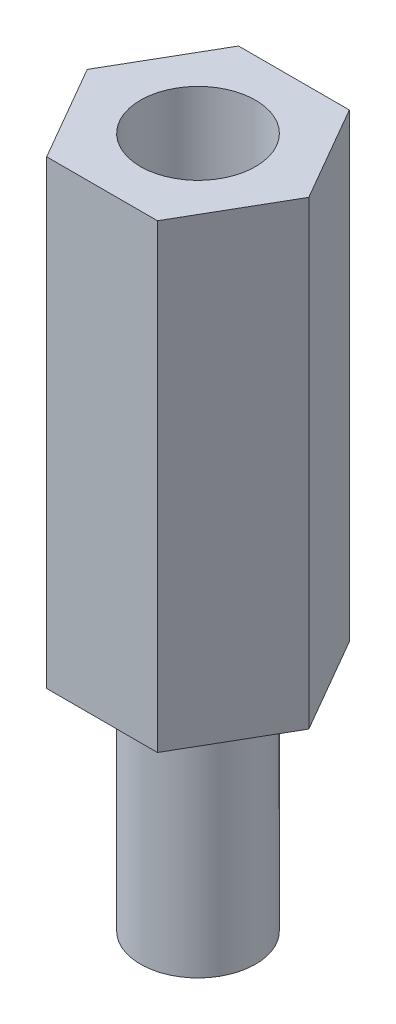
ISO-10303-21;
HEADER;
FILE_DESCRIPTION(('STEP AP214'),'2;1');
FILE_NAME('part.step','',(''),(''),'','','');
FILE_SCHEMA(('AUTOMOTIVE_DESIGN { 1 0 10303 214 1 1 1 1 }'));
ENDSEC;
DATA;
#1=APPLICATION_CONTEXT('core data for automotive mechanical design processes');
#2=APPLICATION_PROTOCOL_DEFINITION('international standard','automotive_design',2000,#1);
#3=PRODUCT_CONTEXT('',#1,'mechanical');
#4=PRODUCT('Part','Part','',(#3));
#5=PRODUCT_RELATED_PRODUCT_CATEGORY('part','',(#4));
#6=PRODUCT_DEFINITION_FORMATION('','',#4);
#7=PRODUCT_DEFINITION_CONTEXT('part definition',#1,'design');
#8=PRODUCT_DEFINITION('design','',#6,#7);
#9=PRODUCT_DEFINITION_SHAPE('','',#8);
#10=(LENGTH_UNIT() NAMED_UNIT(*) SI_UNIT(.MILLI.,.METRE.));
#11=(NAMED_UNIT(*) PLANE_ANGLE_UNIT() SI_UNIT($,.RADIAN.));
#12=(NAMED_UNIT(*) SI_UNIT($,.STERADIAN.) SOLID_ANGLE_UNIT());
#13=UNCERTAINTY_MEASURE_WITH_UNIT(LENGTH_MEASURE(1.E-05),#10,'distance_accuracy_value','');
#14=(GEOMETRIC_REPRESENTATION_CONTEXT(3) GLOBAL_UNCERTAINTY_ASSIGNED_CONTEXT((#13)) GLOBAL_UNIT_ASSIGNED_CONTEXT((#10,
#11,#12)) REPRESENTATION_CONTEXT('',''));
#15=CARTESIAN_POINT('',(0.,0.,0.));
#16=DIRECTION('',(0.,0.,1.));
#17=DIRECTION('',(1.,0.,0.));
#18=AXIS2_PLACEMENT_3D('',#15,#16,#17);
#19=CARTESIAN_POINT('',(0.,-6.,0.));
#20=DIRECTION('',(0.,1.,0.));
#21=DIRECTION('',(0.,0.,1.));
#22=AXIS2_PLACEMENT_3D('',#19,#20,#21);
#23=CYLINDRICAL_SURFACE('',#22,1.5);
#24=CARTESIAN_POINT('',(0.,-6.,0.));
#25=DIRECTION('',(0.,-1.,0.));
#26=DIRECTION('',(0.,0.,-1.));
#27=AXIS2_PLACEMENT_3D('',#24,#25,#26);
#28=CIRCLE('',#27,1.5);
#29=CARTESIAN_POINT('',(0.,-6.,-1.5));
#30=VERTEX_POINT('',#29);
#31=EDGE_CURVE('E11',#30,#30,#28,.T.);
#32=ORIENTED_EDGE('',*,*,#31,.F.);
#33=EDGE_LOOP('',(#32));
#34=FACE_BOUND('',#33,.T.);
#35=CARTESIAN_POINT('',(0.,0.,0.));
#36=DIRECTION('',(0.,-1.,0.));
#37=DIRECTION('',(0.,0.,-1.));
#38=AXIS2_PLACEMENT_3D('',#35,#36,#37);
#39=CIRCLE('',#38,1.5);
#40=CARTESIAN_POINT('',(0.,0.,-1.5));
#41=VERTEX_POINT('',#40);
#42=EDGE_CURVE('E44',#41,#41,#39,.T.);
#43=ORIENTED_EDGE('',*,*,#42,.T.);
#44=EDGE_LOOP('',(#43));
#45=FACE_BOUND('',#44,.T.);
#46=ADVANCED_FACE('F41',(#34,#45),#23,.T.);
#47=CARTESIAN_POINT('',(0.,-6.,0.));
#48=DIRECTION('',(0.,-1.,0.));
#49=DIRECTION('',(0.,0.,-1.));
#50=AXIS2_PLACEMENT_3D('',#47,#48,#49);
#51=PLANE('',#50);
#52=ORIENTED_EDGE('',*,*,#31,.T.);
#53=EDGE_LOOP('',(#52));
#54=FACE_BOUND('',#53,.T.);
#55=ADVANCED_FACE('F56',(#54),#51,.T.);
#56=CARTESIAN_POINT('',(0.,0.,0.));
#57=DIRECTION('',(0.,-1.,0.));
#58=DIRECTION('',(0.,0.,-1.));
#59=AXIS2_PLACEMENT_3D('',#56,#57,#58);
#60=PLANE('',#59);
#61=ORIENTED_EDGE('',*,*,#42,.F.);
#62=EDGE_LOOP('',(#61));
#63=FACE_BOUND('',#62,.T.);
#64=ADVANCED_FACE('F54',(#63),#60,.F.);
#65=CLOSED_SHELL('',(#46,#55,#64));
#66=MANIFOLD_SOLID_BREP('B2',#65);
#67=CARTESIAN_POINT('',(0.,12.,0.));
#68=DIRECTION('',(0.,1.,0.));
#69=DIRECTION('',(0.,0.,1.));
#70=AXIS2_PLACEMENT_3D('',#67,#68,#69);
#71=PLANE('',#70);
#72=DIRECTION('',(1.,0.,0.));
#73=VECTOR('',#72,1.);
#74=CARTESIAN_POINT('',(-1.44337567297405,12.,2.5));
#75=LINE('',#74,#73);
#76=CARTESIAN_POINT('',(-1.44337567297405,12.,2.5));
#77=VERTEX_POINT('',#76);
#78=CARTESIAN_POINT('',(1.44337567297408,12.,2.5));
#79=VERTEX_POINT('',#78);
#80=EDGE_CURVE('E178',#77,#79,#75,.T.);
#81=ORIENTED_EDGE('',*,*,#80,.T.);
#82=DIRECTION('',(0.500000000000001,0.,-0.866025403784438));
#83=VECTOR('',#82,1.);
#84=CARTESIAN_POINT('',(1.44337567297408,12.,2.5));
#85=LINE('',#84,#83);
#86=CARTESIAN_POINT('',(2.88675134594815,12.,0.));
#87=VERTEX_POINT('',#86);
#88=EDGE_CURVE('E136',#79,#87,#85,.T.);
#89=ORIENTED_EDGE('',*,*,#88,.T.);
#90=DIRECTION('',(-0.500000000000001,0.,-0.866025403784438));
#91=VECTOR('',#90,1.);
#92=CARTESIAN_POINT('',(2.88675134594815,12.,0.));
#93=LINE('',#92,#91);
#94=CARTESIAN_POINT('',(1.44337567297408,12.,-2.50000000000001));
#95=VERTEX_POINT('',#94);
#96=EDGE_CURVE('E149',#87,#95,#93,.T.);
#97=ORIENTED_EDGE('',*,*,#96,.T.);
#98=DIRECTION('',(-1.,0.,0.));
#99=VECTOR('',#98,1.);
#100=CARTESIAN_POINT('',(1.44337567297408,12.,-2.50000000000001));
#101=LINE('',#100,#99);
#102=CARTESIAN_POINT('',(-1.44337567297405,12.,-2.50000000000001));
#103=VERTEX_POINT('',#102);
#104=EDGE_CURVE('E143',#95,#103,#101,.T.);
#105=ORIENTED_EDGE('',*,*,#104,.T.);
#106=DIRECTION('',(-0.5,0.,0.866025403784438));
#107=VECTOR('',#106,1.);
#108=CARTESIAN_POINT('',(-1.44337567297405,12.,-2.50000000000001));
#109=LINE('',#108,#107);
#110=CARTESIAN_POINT('',(-2.88675134594812,12.,0.));
#111=VERTEX_POINT('',#110);
#112=EDGE_CURVE('E147',#103,#111,#109,.T.);
#113=ORIENTED_EDGE('',*,*,#112,.T.);
#114=DIRECTION('',(0.5,0.,0.866025403784438));
#115=VECTOR('',#114,1.);
#116=CARTESIAN_POINT('',(-2.88675134594812,12.,0.));
#117=LINE('',#116,#115);
#118=EDGE_CURVE('E99',#111,#77,#117,.T.);
#119=ORIENTED_EDGE('',*,*,#118,.T.);
#120=EDGE_LOOP('',(#81,#89,#97,#105,#113,#119));
#121=FACE_BOUND('',#120,.T.);
#122=CARTESIAN_POINT('',(0.,12.,0.));
#123=DIRECTION('',(0.,1.,0.));
#124=DIRECTION('',(0.,0.,1.));
#125=AXIS2_PLACEMENT_3D('',#122,#123,#124);
#126=CIRCLE('',#125,1.5);
#127=CARTESIAN_POINT('',(0.,12.,1.5));
#128=VERTEX_POINT('',#127);
#129=EDGE_CURVE('E171',#128,#128,#126,.T.);
#130=ORIENTED_EDGE('',*,*,#129,.F.);
#131=EDGE_LOOP('',(#130));
#132=FACE_BOUND('',#131,.T.);
#133=ADVANCED_FACE('F82',(#121,#132),#71,.T.);
#134=CARTESIAN_POINT('',(0.,0.,0.));
#135=DIRECTION('',(0.,1.,0.));
#136=DIRECTION('',(0.,0.,1.));
#137=AXIS2_PLACEMENT_3D('',#134,#135,#136);
#138=PLANE('',#137);
#139=DIRECTION('',(1.,0.,0.));
#140=VECTOR('',#139,1.);
#141=CARTESIAN_POINT('',(-1.44337567297405,0.,2.5));
#142=LINE('',#141,#140);
#143=CARTESIAN_POINT('',(-1.44337567297405,0.,2.5));
#144=VERTEX_POINT('',#143);
#145=CARTESIAN_POINT('',(1.44337567297408,0.,2.5));
#146=VERTEX_POINT('',#145);
#147=EDGE_CURVE('E167',#144,#146,#142,.T.);
#148=ORIENTED_EDGE('',*,*,#147,.F.);
#149=DIRECTION('',(0.5,0.,0.866025403784438));
#150=VECTOR('',#149,1.);
#151=CARTESIAN_POINT('',(-2.88675134594812,0.,0.));
#152=LINE('',#151,#150);
#153=CARTESIAN_POINT('',(-2.88675134594812,0.,0.));
#154=VERTEX_POINT('',#153);
#155=EDGE_CURVE('E128',#154,#144,#152,.T.);
#156=ORIENTED_EDGE('',*,*,#155,.F.);
#157=DIRECTION('',(-0.5,0.,0.866025403784438));
#158=VECTOR('',#157,1.);
#159=CARTESIAN_POINT('',(-1.44337567297405,0.,-2.50000000000001));
#160=LINE('',#159,#158);
#161=CARTESIAN_POINT('',(-1.44337567297405,0.,-2.50000000000001));
#162=VERTEX_POINT('',#161);
#163=EDGE_CURVE('E122',#162,#154,#160,.T.);
#164=ORIENTED_EDGE('',*,*,#163,.F.);
#165=DIRECTION('',(-1.,0.,0.));
#166=VECTOR('',#165,1.);
#167=CARTESIAN_POINT('',(1.44337567297408,0.,-2.50000000000001));
#168=LINE('',#167,#166);
#169=CARTESIAN_POINT('',(1.44337567297408,0.,-2.50000000000001));
#170=VERTEX_POINT('',#169);
#171=EDGE_CURVE('E157',#170,#162,#168,.T.);
#172=ORIENTED_EDGE('',*,*,#171,.F.);
#173=DIRECTION('',(-0.500000000000001,0.,-0.866025403784438));
#174=VECTOR('',#173,1.);
#175=CARTESIAN_POINT('',(2.88675134594815,0.,0.));
#176=LINE('',#175,#174);
#177=CARTESIAN_POINT('',(2.88675134594815,0.,0.));
#178=VERTEX_POINT('',#177);
#179=EDGE_CURVE('E173',#178,#170,#176,.T.);
#180=ORIENTED_EDGE('',*,*,#179,.F.);
#181=DIRECTION('',(0.500000000000001,0.,-0.866025403784438));
#182=VECTOR('',#181,1.);
#183=CARTESIAN_POINT('',(1.44337567297408,0.,2.5));
#184=LINE('',#183,#182);
#185=EDGE_CURVE('E170',#146,#178,#184,.T.);
#186=ORIENTED_EDGE('',*,*,#185,.F.);
#187=EDGE_LOOP('',(#148,#156,#164,#172,#180,#186));
#188=FACE_BOUND('',#187,.T.);
#189=CARTESIAN_POINT('',(0.,0.,0.));
#190=DIRECTION('',(0.,1.,0.));
#191=DIRECTION('',(0.,0.,1.));
#192=AXIS2_PLACEMENT_3D('',#189,#190,#191);
#193=CIRCLE('',#192,1.5);
#194=CARTESIAN_POINT('',(0.,0.,1.5));
#195=VERTEX_POINT('',#194);
#196=EDGE_CURVE('E271',#195,#195,#193,.T.);
#197=ORIENTED_EDGE('',*,*,#196,.T.);
#198=EDGE_LOOP('',(#197));
#199=FACE_BOUND('',#198,.T.);
#200=ADVANCED_FACE('F187',(#188,#199),#138,.F.);
#201=CARTESIAN_POINT('',(-1.44337567297405,12.,2.5));
#202=DIRECTION('',(0.,0.,-1.));
#203=DIRECTION('',(-1.,0.,0.));
#204=AXIS2_PLACEMENT_3D('',#201,#202,#203);
#205=PLANE('',#204);
#206=ORIENTED_EDGE('',*,*,#147,.T.);
#207=DIRECTION('',(0.,-1.,0.));
#208=VECTOR('',#207,1.);
#209=CARTESIAN_POINT('',(1.44337567297408,12.,2.5));
#210=LINE('',#209,#208);
#211=EDGE_CURVE('E39',#79,#146,#210,.T.);
#212=ORIENTED_EDGE('',*,*,#211,.F.);
#213=ORIENTED_EDGE('',*,*,#80,.F.);
#214=DIRECTION('',(0.,-1.,0.));
#215=VECTOR('',#214,1.);
#216=CARTESIAN_POINT('',(-1.44337567297405,12.,2.5));
#217=LINE('',#216,#215);
#218=EDGE_CURVE('E163',#77,#144,#217,.T.);
#219=ORIENTED_EDGE('',*,*,#218,.T.);
#220=EDGE_LOOP('',(#206,#212,#213,#219));
#221=FACE_BOUND('',#220,.T.);
#222=ADVANCED_FACE('F84',(#221),#205,.F.);
#223=CARTESIAN_POINT('',(1.44337567297408,12.,2.5));
#224=DIRECTION('',(-0.866025403784438,0.,-0.500000000000001));
#225=DIRECTION('',(-0.500000000000001,0.,0.866025403784438));
#226=AXIS2_PLACEMENT_3D('',#223,#224,#225);
#227=PLANE('',#226);
#228=ORIENTED_EDGE('',*,*,#185,.T.);
#229=DIRECTION('',(0.,-1.,0.));
#230=VECTOR('',#229,1.);
#231=CARTESIAN_POINT('',(2.88675134594815,12.,0.));
#232=LINE('',#231,#230);
#233=EDGE_CURVE('E91',#87,#178,#232,.T.);
#234=ORIENTED_EDGE('',*,*,#233,.F.);
#235=ORIENTED_EDGE('',*,*,#88,.F.);
#236=ORIENTED_EDGE('',*,*,#211,.T.);
#237=EDGE_LOOP('',(#228,#234,#235,#236));
#238=FACE_BOUND('',#237,.T.);
#239=ADVANCED_FACE('F212',(#238),#227,.F.);
#240=CARTESIAN_POINT('',(2.88675134594815,12.,0.));
#241=DIRECTION('',(-0.866025403784438,0.,0.500000000000001));
#242=DIRECTION('',(0.500000000000001,0.,0.866025403784438));
#243=AXIS2_PLACEMENT_3D('',#240,#241,#242);
#244=PLANE('',#243);
#245=ORIENTED_EDGE('',*,*,#179,.T.);
#246=DIRECTION('',(0.,-1.,0.));
#247=VECTOR('',#246,1.);
#248=CARTESIAN_POINT('',(1.44337567297408,12.,-2.50000000000001));
#249=LINE('',#248,#247);
#250=EDGE_CURVE('E158',#95,#170,#249,.T.);
#251=ORIENTED_EDGE('',*,*,#250,.F.);
#252=ORIENTED_EDGE('',*,*,#96,.F.);
#253=ORIENTED_EDGE('',*,*,#233,.T.);
#254=EDGE_LOOP('',(#245,#251,#252,#253));
#255=FACE_BOUND('',#254,.T.);
#256=ADVANCED_FACE('F184',(#255),#244,.F.);
#257=CARTESIAN_POINT('',(1.44337567297408,12.,-2.50000000000001));
#258=DIRECTION('',(0.,0.,1.));
#259=DIRECTION('',(1.,0.,0.));
#260=AXIS2_PLACEMENT_3D('',#257,#258,#259);
#261=PLANE('',#260);
#262=ORIENTED_EDGE('',*,*,#171,.T.);
#263=DIRECTION('',(0.,-1.,0.));
#264=VECTOR('',#263,1.);
#265=CARTESIAN_POINT('',(-1.44337567297405,12.,-2.50000000000001));
#266=LINE('',#265,#264);
#267=EDGE_CURVE('E154',#103,#162,#266,.T.);
#268=ORIENTED_EDGE('',*,*,#267,.F.);
#269=ORIENTED_EDGE('',*,*,#104,.F.);
#270=ORIENTED_EDGE('',*,*,#250,.T.);
#271=EDGE_LOOP('',(#262,#268,#269,#270));
#272=FACE_BOUND('',#271,.T.);
#273=ADVANCED_FACE('F155',(#272),#261,.F.);
#274=CARTESIAN_POINT('',(-1.44337567297405,12.,-2.50000000000001));
#275=DIRECTION('',(0.866025403784439,0.,0.5));
#276=DIRECTION('',(0.5,0.,-0.866025403784439));
#277=AXIS2_PLACEMENT_3D('',#274,#275,#276);
#278=PLANE('',#277);
#279=ORIENTED_EDGE('',*,*,#163,.T.);
#280=DIRECTION('',(0.,-1.,0.));
#281=VECTOR('',#280,1.);
#282=CARTESIAN_POINT('',(-2.88675134594812,12.,0.));
#283=LINE('',#282,#281);
#284=EDGE_CURVE('E159',#111,#154,#283,.T.);
#285=ORIENTED_EDGE('',*,*,#284,.F.);
#286=ORIENTED_EDGE('',*,*,#112,.F.);
#287=ORIENTED_EDGE('',*,*,#267,.T.);
#288=EDGE_LOOP('',(#279,#285,#286,#287));
#289=FACE_BOUND('',#288,.T.);
#290=ADVANCED_FACE('F161',(#289),#278,.F.);
#291=CARTESIAN_POINT('',(-2.88675134594812,12.,0.));
#292=DIRECTION('',(0.866025403784438,0.,-0.500000000000001));
#293=DIRECTION('',(-0.500000000000001,0.,-0.866025403784438));
#294=AXIS2_PLACEMENT_3D('',#291,#292,#293);
#295=PLANE('',#294);
#296=ORIENTED_EDGE('',*,*,#155,.T.);
#297=ORIENTED_EDGE('',*,*,#218,.F.);
#298=ORIENTED_EDGE('',*,*,#118,.F.);
#299=ORIENTED_EDGE('',*,*,#284,.T.);
#300=EDGE_LOOP('',(#296,#297,#298,#299));
#301=FACE_BOUND('',#300,.T.);
#302=ADVANCED_FACE('F192',(#301),#295,.F.);
#303=CARTESIAN_POINT('',(0.,12.,0.));
#304=DIRECTION('',(0.,-1.,0.));
#305=DIRECTION('',(0.,0.,-1.));
#306=AXIS2_PLACEMENT_3D('',#303,#304,#305);
#307=CYLINDRICAL_SURFACE('',#306,1.5);
#308=ORIENTED_EDGE('',*,*,#129,.T.);
#309=EDGE_LOOP('',(#308));
#310=FACE_BOUND('',#309,.T.);
#311=ORIENTED_EDGE('',*,*,#196,.F.);
#312=EDGE_LOOP('',(#311));
#313=FACE_BOUND('',#312,.T.);
#314=ADVANCED_FACE('F194',(#310,#313),#307,.F.);
#315=CLOSED_SHELL('',(#133,#200,#222,#239,#256,#273,#290,#302,#314));
#316=MANIFOLD_SOLID_BREP('B6',#315);
#317=ADVANCED_BREP_SHAPE_REPRESENTATION('',(#18,#66,#316),#14);
#318=SHAPE_DEFINITION_REPRESENTATION(#9,#317);
ENDSEC;
END-ISO-10303-21;
